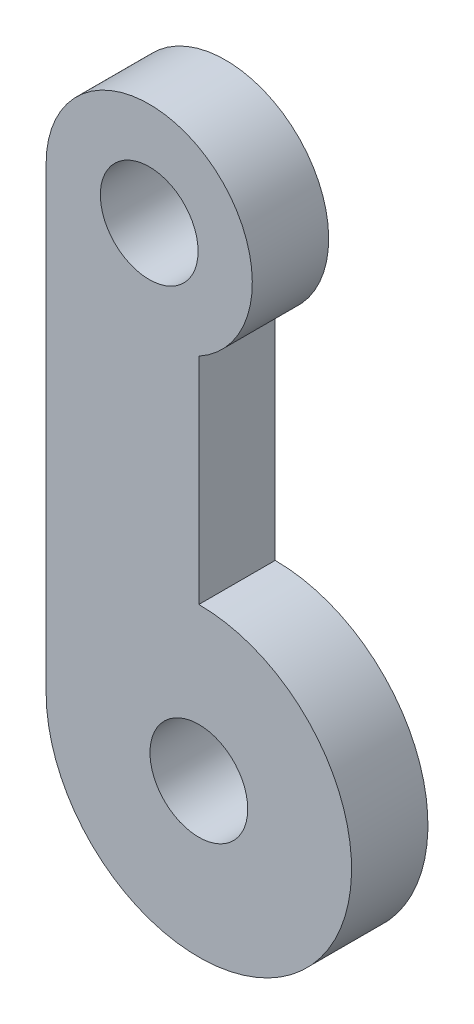
ISO-10303-21;
HEADER;
FILE_DESCRIPTION(('STEP AP214'),'2;1');
FILE_NAME('part.step','',(''),(''),'','','');
FILE_SCHEMA(('AUTOMOTIVE_DESIGN { 1 0 10303 214 1 1 1 1 }'));
ENDSEC;
DATA;
#1=APPLICATION_CONTEXT('core data for automotive mechanical design processes');
#2=APPLICATION_PROTOCOL_DEFINITION('international standard','automotive_design',2000,#1);
#3=PRODUCT_CONTEXT('',#1,'mechanical');
#4=PRODUCT('Part','Part','',(#3));
#5=PRODUCT_RELATED_PRODUCT_CATEGORY('part','',(#4));
#6=PRODUCT_DEFINITION_FORMATION('','',#4);
#7=PRODUCT_DEFINITION_CONTEXT('part definition',#1,'design');
#8=PRODUCT_DEFINITION('design','',#6,#7);
#9=PRODUCT_DEFINITION_SHAPE('','',#8);
#10=(LENGTH_UNIT() NAMED_UNIT(*) SI_UNIT(.MILLI.,.METRE.));
#11=(NAMED_UNIT(*) PLANE_ANGLE_UNIT() SI_UNIT($,.RADIAN.));
#12=(NAMED_UNIT(*) SI_UNIT($,.STERADIAN.) SOLID_ANGLE_UNIT());
#13=UNCERTAINTY_MEASURE_WITH_UNIT(LENGTH_MEASURE(1.E-05),#10,'distance_accuracy_value','');
#14=(GEOMETRIC_REPRESENTATION_CONTEXT(3) GLOBAL_UNCERTAINTY_ASSIGNED_CONTEXT((#13)) GLOBAL_UNIT_ASSIGNED_CONTEXT((#10,
#11,#12)) REPRESENTATION_CONTEXT('',''));
#15=CARTESIAN_POINT('',(0.,0.,0.));
#16=DIRECTION('',(0.,0.,1.));
#17=DIRECTION('',(1.,0.,0.));
#18=AXIS2_PLACEMENT_3D('',#15,#16,#17);
#19=CARTESIAN_POINT('',(0.,0.,2.5));
#20=DIRECTION('',(0.,0.,1.));
#21=DIRECTION('',(1.,0.,0.));
#22=AXIS2_PLACEMENT_3D('',#19,#20,#21);
#23=PLANE('',#22);
#24=CARTESIAN_POINT('',(1.625,-15.,2.5));
#25=DIRECTION('',(0.,0.,1.));
#26=DIRECTION('',(1.,0.,0.));
#27=AXIS2_PLACEMENT_3D('',#24,#25,#26);
#28=CIRCLE('',#27,5.);
#29=CARTESIAN_POINT('',(-3.375,-15.,2.5));
#30=VERTEX_POINT('',#29);
#31=CARTESIAN_POINT('',(1.625,-10.,2.5));
#32=VERTEX_POINT('',#31);
#33=EDGE_CURVE('E100',#30,#32,#28,.T.);
#34=ORIENTED_EDGE('',*,*,#33,.T.);
#35=DIRECTION('',(0.,1.,0.));
#36=VECTOR('',#35,1.);
#37=CARTESIAN_POINT('',(1.625,0.,2.5));
#38=LINE('',#37,#36);
#39=CARTESIAN_POINT('',(1.625,-2.95803989154981,2.5));
#40=VERTEX_POINT('',#39);
#41=EDGE_CURVE('E93',#32,#40,#38,.T.);
#42=ORIENTED_EDGE('',*,*,#41,.T.);
#43=CARTESIAN_POINT('',(0.,0.,2.5));
#44=DIRECTION('',(0.,0.,1.));
#45=DIRECTION('',(1.,0.,0.));
#46=AXIS2_PLACEMENT_3D('',#43,#44,#45);
#47=CIRCLE('',#46,3.375);
#48=CARTESIAN_POINT('',(-3.375,0.,2.5));
#49=VERTEX_POINT('',#48);
#50=EDGE_CURVE('E99',#40,#49,#47,.T.);
#51=ORIENTED_EDGE('',*,*,#50,.T.);
#52=DIRECTION('',(0.,1.,0.));
#53=VECTOR('',#52,1.);
#54=CARTESIAN_POINT('',(-3.375,0.,2.5));
#55=LINE('',#54,#53);
#56=EDGE_CURVE('E109',#30,#49,#55,.T.);
#57=ORIENTED_EDGE('',*,*,#56,.F.);
#58=EDGE_LOOP('',(#34,#42,#51,#57));
#59=FACE_BOUND('',#58,.T.);
#60=CARTESIAN_POINT('',(1.625,-15.,2.5));
#61=DIRECTION('',(0.,0.,1.));
#62=DIRECTION('',(1.,0.,0.));
#63=AXIS2_PLACEMENT_3D('',#60,#61,#62);
#64=CIRCLE('',#63,1.6);
#65=CARTESIAN_POINT('',(3.225,-15.,2.5));
#66=VERTEX_POINT('',#65);
#67=EDGE_CURVE('E126',#66,#66,#64,.T.);
#68=ORIENTED_EDGE('',*,*,#67,.F.);
#69=EDGE_LOOP('',(#68));
#70=FACE_BOUND('',#69,.T.);
#71=CARTESIAN_POINT('',(0.,0.,2.5));
#72=DIRECTION('',(0.,0.,1.));
#73=DIRECTION('',(1.,0.,0.));
#74=AXIS2_PLACEMENT_3D('',#71,#72,#73);
#75=CIRCLE('',#74,1.6);
#76=CARTESIAN_POINT('',(1.6,0.,2.5));
#77=VERTEX_POINT('',#76);
#78=EDGE_CURVE('E118',#77,#77,#75,.T.);
#79=ORIENTED_EDGE('',*,*,#78,.F.);
#80=EDGE_LOOP('',(#79));
#81=FACE_BOUND('',#80,.T.);
#82=ADVANCED_FACE('F50',(#59,#70,#81),#23,.T.);
#83=CARTESIAN_POINT('',(0.,0.,0.));
#84=DIRECTION('',(0.,0.,1.));
#85=DIRECTION('',(1.,0.,0.));
#86=AXIS2_PLACEMENT_3D('',#83,#84,#85);
#87=PLANE('',#86);
#88=CARTESIAN_POINT('',(1.625,-15.,0.));
#89=DIRECTION('',(0.,0.,1.));
#90=DIRECTION('',(1.,0.,0.));
#91=AXIS2_PLACEMENT_3D('',#88,#89,#90);
#92=CIRCLE('',#91,1.6);
#93=CARTESIAN_POINT('',(3.225,-15.,0.));
#94=VERTEX_POINT('',#93);
#95=EDGE_CURVE('E114',#94,#94,#92,.T.);
#96=ORIENTED_EDGE('',*,*,#95,.T.);
#97=EDGE_LOOP('',(#96));
#98=FACE_BOUND('',#97,.T.);
#99=CARTESIAN_POINT('',(1.625,-15.,0.));
#100=DIRECTION('',(0.,0.,1.));
#101=DIRECTION('',(1.,0.,0.));
#102=AXIS2_PLACEMENT_3D('',#99,#100,#101);
#103=CIRCLE('',#102,5.);
#104=CARTESIAN_POINT('',(-3.375,-15.,0.));
#105=VERTEX_POINT('',#104);
#106=CARTESIAN_POINT('',(1.625,-10.,0.));
#107=VERTEX_POINT('',#106);
#108=EDGE_CURVE('E117',#105,#107,#103,.T.);
#109=ORIENTED_EDGE('',*,*,#108,.F.);
#110=DIRECTION('',(0.,1.,0.));
#111=VECTOR('',#110,1.);
#112=CARTESIAN_POINT('',(-3.375,0.,0.));
#113=LINE('',#112,#111);
#114=CARTESIAN_POINT('',(-3.375,0.,0.));
#115=VERTEX_POINT('',#114);
#116=EDGE_CURVE('E123',#105,#115,#113,.T.);
#117=ORIENTED_EDGE('',*,*,#116,.T.);
#118=CARTESIAN_POINT('',(0.,0.,0.));
#119=DIRECTION('',(0.,0.,1.));
#120=DIRECTION('',(1.,0.,0.));
#121=AXIS2_PLACEMENT_3D('',#118,#119,#120);
#122=CIRCLE('',#121,3.375);
#123=CARTESIAN_POINT('',(1.625,-2.95803989154981,0.));
#124=VERTEX_POINT('',#123);
#125=EDGE_CURVE('E121',#124,#115,#122,.T.);
#126=ORIENTED_EDGE('',*,*,#125,.F.);
#127=DIRECTION('',(0.,1.,0.));
#128=VECTOR('',#127,1.);
#129=CARTESIAN_POINT('',(1.625,0.,0.));
#130=LINE('',#129,#128);
#131=EDGE_CURVE('E105',#107,#124,#130,.T.);
#132=ORIENTED_EDGE('',*,*,#131,.F.);
#133=EDGE_LOOP('',(#109,#117,#126,#132));
#134=FACE_BOUND('',#133,.T.);
#135=CARTESIAN_POINT('',(0.,0.,0.));
#136=DIRECTION('',(0.,0.,1.));
#137=DIRECTION('',(1.,0.,0.));
#138=AXIS2_PLACEMENT_3D('',#135,#136,#137);
#139=CIRCLE('',#138,1.6);
#140=CARTESIAN_POINT('',(1.6,0.,0.));
#141=VERTEX_POINT('',#140);
#142=EDGE_CURVE('E134',#141,#141,#139,.T.);
#143=ORIENTED_EDGE('',*,*,#142,.T.);
#144=EDGE_LOOP('',(#143));
#145=FACE_BOUND('',#144,.T.);
#146=ADVANCED_FACE('F144',(#98,#134,#145),#87,.F.);
#147=CARTESIAN_POINT('',(1.625,-15.,2.5));
#148=DIRECTION('',(0.,0.,-1.));
#149=DIRECTION('',(-1.,0.,0.));
#150=AXIS2_PLACEMENT_3D('',#147,#148,#149);
#151=CYLINDRICAL_SURFACE('',#150,5.);
#152=ORIENTED_EDGE('',*,*,#108,.T.);
#153=DIRECTION('',(0.,0.,-1.));
#154=VECTOR('',#153,1.);
#155=CARTESIAN_POINT('',(1.625,-10.,2.5));
#156=LINE('',#155,#154);
#157=EDGE_CURVE('E12',#32,#107,#156,.T.);
#158=ORIENTED_EDGE('',*,*,#157,.F.);
#159=ORIENTED_EDGE('',*,*,#33,.F.);
#160=DIRECTION('',(0.,0.,-1.));
#161=VECTOR('',#160,1.);
#162=CARTESIAN_POINT('',(-3.375,-15.,2.5));
#163=LINE('',#162,#161);
#164=EDGE_CURVE('E67',#30,#105,#163,.T.);
#165=ORIENTED_EDGE('',*,*,#164,.T.);
#166=EDGE_LOOP('',(#152,#158,#159,#165));
#167=FACE_BOUND('',#166,.T.);
#168=ADVANCED_FACE('F149',(#167),#151,.T.);
#169=CARTESIAN_POINT('',(1.625,0.,2.5));
#170=DIRECTION('',(-1.,0.,0.));
#171=DIRECTION('',(0.,0.,1.));
#172=AXIS2_PLACEMENT_3D('',#169,#170,#171);
#173=PLANE('',#172);
#174=ORIENTED_EDGE('',*,*,#131,.T.);
#175=DIRECTION('',(0.,0.,-1.));
#176=VECTOR('',#175,1.);
#177=CARTESIAN_POINT('',(1.625,-2.95803989154981,2.5));
#178=LINE('',#177,#176);
#179=EDGE_CURVE('E59',#40,#124,#178,.T.);
#180=ORIENTED_EDGE('',*,*,#179,.F.);
#181=ORIENTED_EDGE('',*,*,#41,.F.);
#182=ORIENTED_EDGE('',*,*,#157,.T.);
#183=EDGE_LOOP('',(#174,#180,#181,#182));
#184=FACE_BOUND('',#183,.T.);
#185=ADVANCED_FACE('F104',(#184),#173,.F.);
#186=CARTESIAN_POINT('',(0.,0.,2.5));
#187=DIRECTION('',(0.,0.,-1.));
#188=DIRECTION('',(-1.,0.,0.));
#189=AXIS2_PLACEMENT_3D('',#186,#187,#188);
#190=CYLINDRICAL_SURFACE('',#189,3.375);
#191=ORIENTED_EDGE('',*,*,#125,.T.);
#192=DIRECTION('',(0.,0.,-1.));
#193=VECTOR('',#192,1.);
#194=CARTESIAN_POINT('',(-3.375,0.,2.5));
#195=LINE('',#194,#193);
#196=EDGE_CURVE('E82',#49,#115,#195,.T.);
#197=ORIENTED_EDGE('',*,*,#196,.F.);
#198=ORIENTED_EDGE('',*,*,#50,.F.);
#199=ORIENTED_EDGE('',*,*,#179,.T.);
#200=EDGE_LOOP('',(#191,#197,#198,#199));
#201=FACE_BOUND('',#200,.T.);
#202=ADVANCED_FACE('F108',(#201),#190,.T.);
#203=CARTESIAN_POINT('',(1.625,-15.,2.5));
#204=DIRECTION('',(0.,0.,-1.));
#205=DIRECTION('',(-1.,0.,0.));
#206=AXIS2_PLACEMENT_3D('',#203,#204,#205);
#207=CYLINDRICAL_SURFACE('',#206,1.6);
#208=ORIENTED_EDGE('',*,*,#67,.T.);
#209=EDGE_LOOP('',(#208));
#210=FACE_BOUND('',#209,.T.);
#211=ORIENTED_EDGE('',*,*,#95,.F.);
#212=EDGE_LOOP('',(#211));
#213=FACE_BOUND('',#212,.T.);
#214=ADVANCED_FACE('F52',(#210,#213),#207,.F.);
#215=CARTESIAN_POINT('',(-3.375,0.,2.5));
#216=DIRECTION('',(-1.,0.,0.));
#217=DIRECTION('',(0.,-1.,0.));
#218=AXIS2_PLACEMENT_3D('',#215,#216,#217);
#219=PLANE('',#218);
#220=ORIENTED_EDGE('',*,*,#116,.F.);
#221=ORIENTED_EDGE('',*,*,#164,.F.);
#222=ORIENTED_EDGE('',*,*,#56,.T.);
#223=ORIENTED_EDGE('',*,*,#196,.T.);
#224=EDGE_LOOP('',(#220,#221,#222,#223));
#225=FACE_BOUND('',#224,.T.);
#226=ADVANCED_FACE('F154',(#225),#219,.T.);
#227=CARTESIAN_POINT('',(0.,0.,2.5));
#228=DIRECTION('',(0.,0.,-1.));
#229=DIRECTION('',(-1.,0.,0.));
#230=AXIS2_PLACEMENT_3D('',#227,#228,#229);
#231=CYLINDRICAL_SURFACE('',#230,1.6);
#232=ORIENTED_EDGE('',*,*,#78,.T.);
#233=EDGE_LOOP('',(#232));
#234=FACE_BOUND('',#233,.T.);
#235=ORIENTED_EDGE('',*,*,#142,.F.);
#236=EDGE_LOOP('',(#235));
#237=FACE_BOUND('',#236,.T.);
#238=ADVANCED_FACE('F140',(#234,#237),#231,.F.);
#239=CLOSED_SHELL('',(#82,#146,#168,#185,#202,#214,#226,#238));
#240=MANIFOLD_SOLID_BREP('B2',#239);
#241=ADVANCED_BREP_SHAPE_REPRESENTATION('',(#18,#240),#14);
#242=SHAPE_DEFINITION_REPRESENTATION(#9,#241);
ENDSEC;
END-ISO-10303-21;
